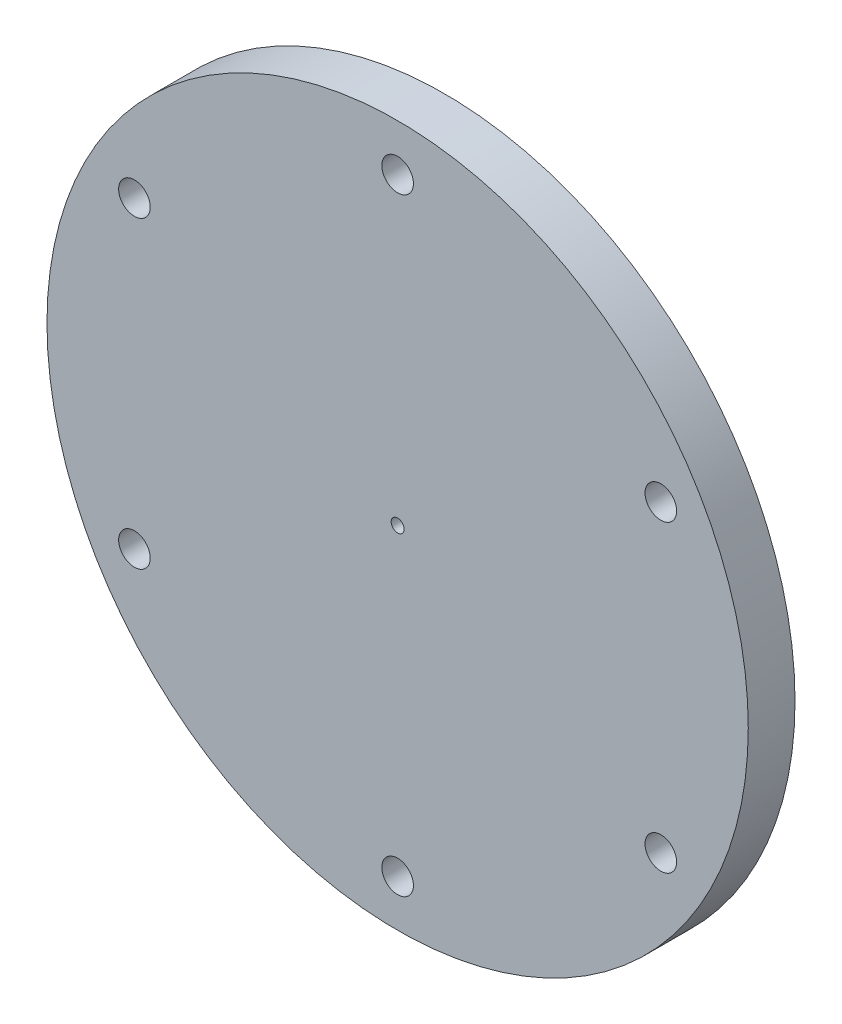
ISO-10303-21;
HEADER;
FILE_DESCRIPTION(('STEP AP214'),'2;1');
FILE_NAME('part.step','',(''),(''),'','','');
FILE_SCHEMA(('AUTOMOTIVE_DESIGN { 1 0 10303 214 1 1 1 1 }'));
ENDSEC;
DATA;
#1=APPLICATION_CONTEXT('core data for automotive mechanical design processes');
#2=APPLICATION_PROTOCOL_DEFINITION('international standard','automotive_design',2000,#1);
#3=PRODUCT_CONTEXT('',#1,'mechanical');
#4=PRODUCT('Part','Part','',(#3));
#5=PRODUCT_RELATED_PRODUCT_CATEGORY('part','',(#4));
#6=PRODUCT_DEFINITION_FORMATION('','',#4);
#7=PRODUCT_DEFINITION_CONTEXT('part definition',#1,'design');
#8=PRODUCT_DEFINITION('design','',#6,#7);
#9=PRODUCT_DEFINITION_SHAPE('','',#8);
#10=(LENGTH_UNIT() NAMED_UNIT(*) SI_UNIT(.MILLI.,.METRE.));
#11=(NAMED_UNIT(*) PLANE_ANGLE_UNIT() SI_UNIT($,.RADIAN.));
#12=(NAMED_UNIT(*) SI_UNIT($,.STERADIAN.) SOLID_ANGLE_UNIT());
#13=UNCERTAINTY_MEASURE_WITH_UNIT(LENGTH_MEASURE(1.E-05),#10,'distance_accuracy_value','');
#14=(GEOMETRIC_REPRESENTATION_CONTEXT(3) GLOBAL_UNCERTAINTY_ASSIGNED_CONTEXT((#13)) GLOBAL_UNIT_ASSIGNED_CONTEXT((#10,
#11,#12)) REPRESENTATION_CONTEXT('',''));
#15=CARTESIAN_POINT('',(0.,0.,0.));
#16=DIRECTION('',(0.,0.,1.));
#17=DIRECTION('',(1.,0.,0.));
#18=AXIS2_PLACEMENT_3D('',#15,#16,#17);
#19=CARTESIAN_POINT('',(0.,0.,5.));
#20=DIRECTION('',(0.,0.,-1.));
#21=DIRECTION('',(-1.,0.,0.));
#22=AXIS2_PLACEMENT_3D('',#19,#20,#21);
#23=CYLINDRICAL_SURFACE('',#22,37.5);
#24=CARTESIAN_POINT('',(0.,0.,5.));
#25=DIRECTION('',(0.,0.,1.));
#26=DIRECTION('',(1.,0.,0.));
#27=AXIS2_PLACEMENT_3D('',#24,#25,#26);
#28=CIRCLE('',#27,37.5);
#29=CARTESIAN_POINT('',(37.5,0.,5.));
#30=VERTEX_POINT('',#29);
#31=EDGE_CURVE('E10',#30,#30,#28,.T.);
#32=ORIENTED_EDGE('',*,*,#31,.F.);
#33=EDGE_LOOP('',(#32));
#34=FACE_BOUND('',#33,.T.);
#35=CARTESIAN_POINT('',(0.,0.,0.));
#36=DIRECTION('',(0.,0.,1.));
#37=DIRECTION('',(1.,0.,0.));
#38=AXIS2_PLACEMENT_3D('',#35,#36,#37);
#39=CIRCLE('',#38,37.5);
#40=CARTESIAN_POINT('',(37.5,0.,0.));
#41=VERTEX_POINT('',#40);
#42=EDGE_CURVE('E34',#41,#41,#39,.T.);
#43=ORIENTED_EDGE('',*,*,#42,.T.);
#44=EDGE_LOOP('',(#43));
#45=FACE_BOUND('',#44,.T.);
#46=ADVANCED_FACE('F31',(#34,#45),#23,.T.);
#47=CARTESIAN_POINT('',(0.,0.,5.));
#48=DIRECTION('',(0.,0.,1.));
#49=DIRECTION('',(1.,0.,0.));
#50=AXIS2_PLACEMENT_3D('',#47,#48,#49);
#51=PLANE('',#50);
#52=CARTESIAN_POINT('',(28.1458256229941,16.2500000000003,5.));
#53=DIRECTION('',(0.,0.,-1.));
#54=DIRECTION('',(-1.,0.,0.));
#55=AXIS2_PLACEMENT_3D('',#52,#53,#54);
#56=CIRCLE('',#55,1.69);
#57=CARTESIAN_POINT('',(26.4558256229941,16.2500000000003,5.));
#58=VERTEX_POINT('',#57);
#59=EDGE_CURVE('E76',#58,#58,#56,.T.);
#60=ORIENTED_EDGE('',*,*,#59,.T.);
#61=EDGE_LOOP('',(#60));
#62=FACE_BOUND('',#61,.T.);
#63=CARTESIAN_POINT('',(28.1458256229944,-16.2499999999997,5.));
#64=DIRECTION('',(0.,0.,-1.));
#65=DIRECTION('',(-1.,0.,0.));
#66=AXIS2_PLACEMENT_3D('',#63,#64,#65);
#67=CIRCLE('',#66,1.69);
#68=CARTESIAN_POINT('',(26.4558256229944,-16.2499999999997,5.));
#69=VERTEX_POINT('',#68);
#70=EDGE_CURVE('E70',#69,#69,#67,.T.);
#71=ORIENTED_EDGE('',*,*,#70,.T.);
#72=EDGE_LOOP('',(#71));
#73=FACE_BOUND('',#72,.T.);
#74=CARTESIAN_POINT('',(2.27558610424378E-13,-32.5,5.));
#75=DIRECTION('',(0.,0.,-1.));
#76=DIRECTION('',(-1.,0.,0.));
#77=AXIS2_PLACEMENT_3D('',#74,#75,#76);
#78=CIRCLE('',#77,1.69);
#79=CARTESIAN_POINT('',(-1.68999999999977,-32.5,5.));
#80=VERTEX_POINT('',#79);
#81=EDGE_CURVE('E64',#80,#80,#78,.T.);
#82=ORIENTED_EDGE('',*,*,#81,.T.);
#83=EDGE_LOOP('',(#82));
#84=FACE_BOUND('',#83,.T.);
#85=CARTESIAN_POINT('',(-28.1458256229942,-16.2500000000001,5.));
#86=DIRECTION('',(0.,0.,-1.));
#87=DIRECTION('',(-1.,0.,0.));
#88=AXIS2_PLACEMENT_3D('',#85,#86,#87);
#89=CIRCLE('',#88,1.69);
#90=CARTESIAN_POINT('',(-29.8358256229942,-16.2500000000001,5.));
#91=VERTEX_POINT('',#90);
#92=EDGE_CURVE('E58',#91,#91,#89,.T.);
#93=ORIENTED_EDGE('',*,*,#92,.T.);
#94=EDGE_LOOP('',(#93));
#95=FACE_BOUND('',#94,.T.);
#96=CARTESIAN_POINT('',(-28.1458256229943,16.2499999999999,5.));
#97=DIRECTION('',(0.,0.,-1.));
#98=DIRECTION('',(-1.,0.,0.));
#99=AXIS2_PLACEMENT_3D('',#96,#97,#98);
#100=CIRCLE('',#99,1.69);
#101=CARTESIAN_POINT('',(-29.8358256229943,16.2499999999999,5.));
#102=VERTEX_POINT('',#101);
#103=EDGE_CURVE('E52',#102,#102,#100,.T.);
#104=ORIENTED_EDGE('',*,*,#103,.T.);
#105=EDGE_LOOP('',(#104));
#106=FACE_BOUND('',#105,.T.);
#107=CARTESIAN_POINT('',(0.,32.5,5.));
#108=DIRECTION('',(0.,0.,-1.));
#109=DIRECTION('',(-1.,0.,0.));
#110=AXIS2_PLACEMENT_3D('',#107,#108,#109);
#111=CIRCLE('',#110,1.69);
#112=CARTESIAN_POINT('',(-1.69,32.5,5.));
#113=VERTEX_POINT('',#112);
#114=EDGE_CURVE('E46',#113,#113,#111,.T.);
#115=ORIENTED_EDGE('',*,*,#114,.T.);
#116=EDGE_LOOP('',(#115));
#117=FACE_BOUND('',#116,.T.);
#118=CARTESIAN_POINT('',(0.,0.,5.));
#119=DIRECTION('',(0.,0.,-1.));
#120=DIRECTION('',(-1.,0.,0.));
#121=AXIS2_PLACEMENT_3D('',#118,#119,#120);
#122=CIRCLE('',#121,0.693);
#123=CARTESIAN_POINT('',(-0.693,0.,5.));
#124=VERTEX_POINT('',#123);
#125=EDGE_CURVE('E41',#124,#124,#122,.T.);
#126=ORIENTED_EDGE('',*,*,#125,.T.);
#127=EDGE_LOOP('',(#126));
#128=FACE_BOUND('',#127,.T.);
#129=ORIENTED_EDGE('',*,*,#31,.T.);
#130=EDGE_LOOP('',(#129));
#131=FACE_BOUND('',#130,.T.);
#132=ADVANCED_FACE('F85',(#62,#73,#84,#95,#106,#117,#128,#131),#51,.T.);
#133=CARTESIAN_POINT('',(0.,0.,0.));
#134=DIRECTION('',(0.,0.,1.));
#135=DIRECTION('',(1.,0.,0.));
#136=AXIS2_PLACEMENT_3D('',#133,#134,#135);
#137=PLANE('',#136);
#138=CARTESIAN_POINT('',(28.1458256229941,16.2500000000003,0.));
#139=DIRECTION('',(0.,0.,-1.));
#140=DIRECTION('',(-1.,0.,0.));
#141=AXIS2_PLACEMENT_3D('',#138,#139,#140);
#142=CIRCLE('',#141,1.69);
#143=CARTESIAN_POINT('',(26.4558256229941,16.2500000000003,0.));
#144=VERTEX_POINT('',#143);
#145=EDGE_CURVE('E79',#144,#144,#142,.T.);
#146=ORIENTED_EDGE('',*,*,#145,.F.);
#147=EDGE_LOOP('',(#146));
#148=FACE_BOUND('',#147,.T.);
#149=CARTESIAN_POINT('',(28.1458256229944,-16.2499999999997,0.));
#150=DIRECTION('',(0.,0.,-1.));
#151=DIRECTION('',(-1.,0.,0.));
#152=AXIS2_PLACEMENT_3D('',#149,#150,#151);
#153=CIRCLE('',#152,1.69);
#154=CARTESIAN_POINT('',(26.4558256229944,-16.2499999999997,0.));
#155=VERTEX_POINT('',#154);
#156=EDGE_CURVE('E73',#155,#155,#153,.T.);
#157=ORIENTED_EDGE('',*,*,#156,.F.);
#158=EDGE_LOOP('',(#157));
#159=FACE_BOUND('',#158,.T.);
#160=CARTESIAN_POINT('',(2.27558610424378E-13,-32.5,0.));
#161=DIRECTION('',(0.,0.,-1.));
#162=DIRECTION('',(-1.,0.,0.));
#163=AXIS2_PLACEMENT_3D('',#160,#161,#162);
#164=CIRCLE('',#163,1.69);
#165=CARTESIAN_POINT('',(-1.68999999999977,-32.5,0.));
#166=VERTEX_POINT('',#165);
#167=EDGE_CURVE('E67',#166,#166,#164,.T.);
#168=ORIENTED_EDGE('',*,*,#167,.F.);
#169=EDGE_LOOP('',(#168));
#170=FACE_BOUND('',#169,.T.);
#171=CARTESIAN_POINT('',(-28.1458256229942,-16.2500000000001,0.));
#172=DIRECTION('',(0.,0.,-1.));
#173=DIRECTION('',(-1.,0.,0.));
#174=AXIS2_PLACEMENT_3D('',#171,#172,#173);
#175=CIRCLE('',#174,1.69);
#176=CARTESIAN_POINT('',(-29.8358256229942,-16.2500000000001,0.));
#177=VERTEX_POINT('',#176);
#178=EDGE_CURVE('E61',#177,#177,#175,.T.);
#179=ORIENTED_EDGE('',*,*,#178,.F.);
#180=EDGE_LOOP('',(#179));
#181=FACE_BOUND('',#180,.T.);
#182=CARTESIAN_POINT('',(-28.1458256229943,16.2499999999999,0.));
#183=DIRECTION('',(0.,0.,-1.));
#184=DIRECTION('',(-1.,0.,0.));
#185=AXIS2_PLACEMENT_3D('',#182,#183,#184);
#186=CIRCLE('',#185,1.69);
#187=CARTESIAN_POINT('',(-29.8358256229943,16.2499999999999,0.));
#188=VERTEX_POINT('',#187);
#189=EDGE_CURVE('E55',#188,#188,#186,.T.);
#190=ORIENTED_EDGE('',*,*,#189,.F.);
#191=EDGE_LOOP('',(#190));
#192=FACE_BOUND('',#191,.T.);
#193=CARTESIAN_POINT('',(0.,32.5,0.));
#194=DIRECTION('',(0.,0.,-1.));
#195=DIRECTION('',(-1.,0.,0.));
#196=AXIS2_PLACEMENT_3D('',#193,#194,#195);
#197=CIRCLE('',#196,1.69);
#198=CARTESIAN_POINT('',(-1.69,32.5,0.));
#199=VERTEX_POINT('',#198);
#200=EDGE_CURVE('E49',#199,#199,#197,.T.);
#201=ORIENTED_EDGE('',*,*,#200,.F.);
#202=EDGE_LOOP('',(#201));
#203=FACE_BOUND('',#202,.T.);
#204=CARTESIAN_POINT('',(0.,0.,0.));
#205=DIRECTION('',(0.,0.,-1.));
#206=DIRECTION('',(-1.,0.,0.));
#207=AXIS2_PLACEMENT_3D('',#204,#205,#206);
#208=CIRCLE('',#207,0.693);
#209=CARTESIAN_POINT('',(-0.693,0.,0.));
#210=VERTEX_POINT('',#209);
#211=EDGE_CURVE('E43',#210,#210,#208,.T.);
#212=ORIENTED_EDGE('',*,*,#211,.F.);
#213=EDGE_LOOP('',(#212));
#214=FACE_BOUND('',#213,.T.);
#215=ORIENTED_EDGE('',*,*,#42,.F.);
#216=EDGE_LOOP('',(#215));
#217=FACE_BOUND('',#216,.T.);
#218=ADVANCED_FACE('F95',(#148,#159,#170,#181,#192,#203,#214,#217),#137,.F.);
#219=CARTESIAN_POINT('',(0.,0.,5.));
#220=DIRECTION('',(0.,0.,-1.));
#221=DIRECTION('',(-1.,0.,0.));
#222=AXIS2_PLACEMENT_3D('',#219,#220,#221);
#223=CYLINDRICAL_SURFACE('',#222,0.693);
#224=ORIENTED_EDGE('',*,*,#125,.F.);
#225=EDGE_LOOP('',(#224));
#226=FACE_BOUND('',#225,.T.);
#227=ORIENTED_EDGE('',*,*,#211,.T.);
#228=EDGE_LOOP('',(#227));
#229=FACE_BOUND('',#228,.T.);
#230=ADVANCED_FACE('F98',(#226,#229),#223,.F.);
#231=CARTESIAN_POINT('',(0.,32.5,5.));
#232=DIRECTION('',(0.,0.,-1.));
#233=DIRECTION('',(-1.,0.,0.));
#234=AXIS2_PLACEMENT_3D('',#231,#232,#233);
#235=CYLINDRICAL_SURFACE('',#234,1.69);
#236=ORIENTED_EDGE('',*,*,#114,.F.);
#237=EDGE_LOOP('',(#236));
#238=FACE_BOUND('',#237,.T.);
#239=ORIENTED_EDGE('',*,*,#200,.T.);
#240=EDGE_LOOP('',(#239));
#241=FACE_BOUND('',#240,.T.);
#242=ADVANCED_FACE('F124',(#238,#241),#235,.F.);
#243=CARTESIAN_POINT('',(-28.1458256229943,16.2499999999999,5.));
#244=DIRECTION('',(0.,0.,-1.));
#245=DIRECTION('',(-1.,0.,0.));
#246=AXIS2_PLACEMENT_3D('',#243,#244,#245);
#247=CYLINDRICAL_SURFACE('',#246,1.69);
#248=ORIENTED_EDGE('',*,*,#103,.F.);
#249=EDGE_LOOP('',(#248));
#250=FACE_BOUND('',#249,.T.);
#251=ORIENTED_EDGE('',*,*,#189,.T.);
#252=EDGE_LOOP('',(#251));
#253=FACE_BOUND('',#252,.T.);
#254=ADVANCED_FACE('F128',(#250,#253),#247,.F.);
#255=CARTESIAN_POINT('',(-28.1458256229942,-16.2500000000001,5.));
#256=DIRECTION('',(0.,0.,-1.));
#257=DIRECTION('',(-1.,0.,0.));
#258=AXIS2_PLACEMENT_3D('',#255,#256,#257);
#259=CYLINDRICAL_SURFACE('',#258,1.69);
#260=ORIENTED_EDGE('',*,*,#92,.F.);
#261=EDGE_LOOP('',(#260));
#262=FACE_BOUND('',#261,.T.);
#263=ORIENTED_EDGE('',*,*,#178,.T.);
#264=EDGE_LOOP('',(#263));
#265=FACE_BOUND('',#264,.T.);
#266=ADVANCED_FACE('F132',(#262,#265),#259,.F.);
#267=CARTESIAN_POINT('',(2.27558610424378E-13,-32.5,5.));
#268=DIRECTION('',(0.,0.,-1.));
#269=DIRECTION('',(-1.,0.,0.));
#270=AXIS2_PLACEMENT_3D('',#267,#268,#269);
#271=CYLINDRICAL_SURFACE('',#270,1.69);
#272=ORIENTED_EDGE('',*,*,#81,.F.);
#273=EDGE_LOOP('',(#272));
#274=FACE_BOUND('',#273,.T.);
#275=ORIENTED_EDGE('',*,*,#167,.T.);
#276=EDGE_LOOP('',(#275));
#277=FACE_BOUND('',#276,.T.);
#278=ADVANCED_FACE('F136',(#274,#277),#271,.F.);
#279=CARTESIAN_POINT('',(28.1458256229944,-16.2499999999997,5.));
#280=DIRECTION('',(0.,0.,-1.));
#281=DIRECTION('',(-1.,0.,0.));
#282=AXIS2_PLACEMENT_3D('',#279,#280,#281);
#283=CYLINDRICAL_SURFACE('',#282,1.69);
#284=ORIENTED_EDGE('',*,*,#70,.F.);
#285=EDGE_LOOP('',(#284));
#286=FACE_BOUND('',#285,.T.);
#287=ORIENTED_EDGE('',*,*,#156,.T.);
#288=EDGE_LOOP('',(#287));
#289=FACE_BOUND('',#288,.T.);
#290=ADVANCED_FACE('F91',(#286,#289),#283,.F.);
#291=CARTESIAN_POINT('',(28.1458256229941,16.2500000000003,5.));
#292=DIRECTION('',(0.,0.,-1.));
#293=DIRECTION('',(-1.,0.,0.));
#294=AXIS2_PLACEMENT_3D('',#291,#292,#293);
#295=CYLINDRICAL_SURFACE('',#294,1.69);
#296=ORIENTED_EDGE('',*,*,#59,.F.);
#297=EDGE_LOOP('',(#296));
#298=FACE_BOUND('',#297,.T.);
#299=ORIENTED_EDGE('',*,*,#145,.T.);
#300=EDGE_LOOP('',(#299));
#301=FACE_BOUND('',#300,.T.);
#302=ADVANCED_FACE('F88',(#298,#301),#295,.F.);
#303=CLOSED_SHELL('',(#46,#132,#218,#230,#242,#254,#266,#278,#290,#302));
#304=MANIFOLD_SOLID_BREP('B2',#303);
#305=ADVANCED_BREP_SHAPE_REPRESENTATION('',(#18,#304),#14);
#306=SHAPE_DEFINITION_REPRESENTATION(#9,#305);
ENDSEC;
END-ISO-10303-21;
